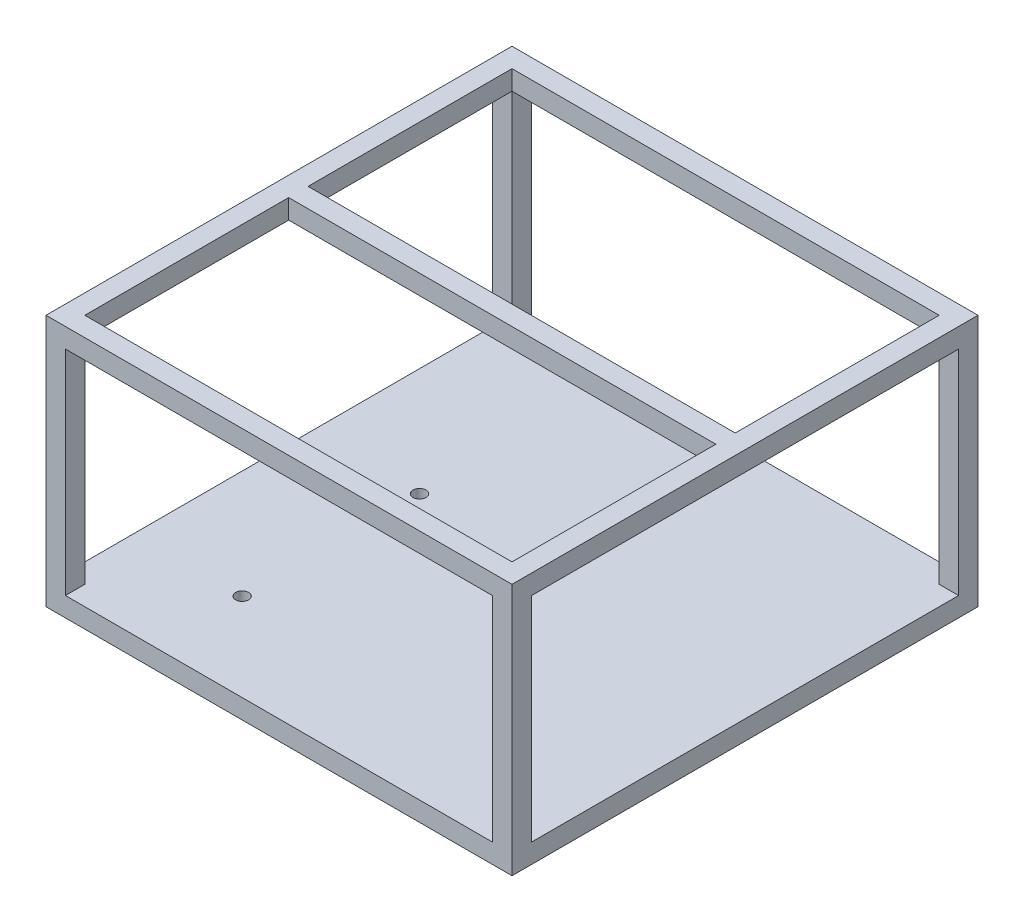
ISO-10303-21;
HEADER;
FILE_DESCRIPTION(('STEP AP214'),'2;1');
FILE_NAME('part.step','',(''),(''),'','','');
FILE_SCHEMA(('AUTOMOTIVE_DESIGN { 1 0 10303 214 1 1 1 1 }'));
ENDSEC;
DATA;
#1=APPLICATION_CONTEXT('core data for automotive mechanical design processes');
#2=APPLICATION_PROTOCOL_DEFINITION('international standard','automotive_design',2000,#1);
#3=PRODUCT_CONTEXT('',#1,'mechanical');
#4=PRODUCT('Part','Part','',(#3));
#5=PRODUCT_RELATED_PRODUCT_CATEGORY('part','',(#4));
#6=PRODUCT_DEFINITION_FORMATION('','',#4);
#7=PRODUCT_DEFINITION_CONTEXT('part definition',#1,'design');
#8=PRODUCT_DEFINITION('design','',#6,#7);
#9=PRODUCT_DEFINITION_SHAPE('','',#8);
#10=(LENGTH_UNIT() NAMED_UNIT(*) SI_UNIT(.MILLI.,.METRE.));
#11=(NAMED_UNIT(*) PLANE_ANGLE_UNIT() SI_UNIT($,.RADIAN.));
#12=(NAMED_UNIT(*) SI_UNIT($,.STERADIAN.) SOLID_ANGLE_UNIT());
#13=UNCERTAINTY_MEASURE_WITH_UNIT(LENGTH_MEASURE(1.E-05),#10,'distance_accuracy_value','');
#14=(GEOMETRIC_REPRESENTATION_CONTEXT(3) GLOBAL_UNCERTAINTY_ASSIGNED_CONTEXT((#13)) GLOBAL_UNIT_ASSIGNED_CONTEXT((#10,
#11,#12)) REPRESENTATION_CONTEXT('',''));
#15=CARTESIAN_POINT('',(0.,0.,0.));
#16=DIRECTION('',(0.,0.,1.));
#17=DIRECTION('',(1.,0.,0.));
#18=AXIS2_PLACEMENT_3D('',#15,#16,#17);
#19=CARTESIAN_POINT('',(110.62658396301,82.55,30.8378605629459));
#20=DIRECTION('',(1.,0.,0.));
#21=DIRECTION('',(0.,0.,-1.));
#22=AXIS2_PLACEMENT_3D('',#19,#20,#21);
#23=PLANE('',#22);
#24=DIRECTION('',(0.,-1.,0.));
#25=VECTOR('',#24,1.);
#26=CARTESIAN_POINT('',(110.62658396301,82.55,-42.1720858432598));
#27=LINE('',#26,#25);
#28=CARTESIAN_POINT('',(110.62658396301,82.55,-42.1720858432598));
#29=VERTEX_POINT('',#28);
#30=CARTESIAN_POINT('',(110.62658396301,76.1659043542835,-42.1720858432598));
#31=VERTEX_POINT('',#30);
#32=EDGE_CURVE('E205',#29,#31,#27,.T.);
#33=ORIENTED_EDGE('',*,*,#32,.T.);
#34=DIRECTION('',(0.,0.,1.));
#35=VECTOR('',#34,1.);
#36=CARTESIAN_POINT('',(110.62658396301,76.1659043542835,-115.212139437054));
#37=LINE('',#36,#35);
#38=CARTESIAN_POINT('',(110.62658396301,76.1659043542835,24.487860562946));
#39=VERTEX_POINT('',#38);
#40=EDGE_CURVE('E191',#31,#39,#37,.T.);
#41=ORIENTED_EDGE('',*,*,#40,.T.);
#42=DIRECTION('',(0.,1.,0.));
#43=VECTOR('',#42,1.);
#44=CARTESIAN_POINT('',(110.62658396301,82.55,24.487860562946));
#45=LINE('',#44,#43);
#46=CARTESIAN_POINT('',(110.62658396301,82.55,24.487860562946));
#47=VERTEX_POINT('',#46);
#48=EDGE_CURVE('E252',#39,#47,#45,.T.);
#49=ORIENTED_EDGE('',*,*,#48,.T.);
#50=DIRECTION('',(0.,0.,1.));
#51=VECTOR('',#50,1.);
#52=CARTESIAN_POINT('',(110.62658396301,82.55,30.8378605629459));
#53=LINE('',#52,#51);
#54=EDGE_CURVE('E55',#29,#47,#53,.T.);
#55=ORIENTED_EDGE('',*,*,#54,.F.);
#56=EDGE_LOOP('',(#33,#41,#49,#55));
#57=FACE_BOUND('',#56,.T.);
#58=ADVANCED_FACE('F39',(#57),#23,.F.);
#59=DIRECTION('',(0.,1.,0.));
#60=VECTOR('',#59,1.);
#61=CARTESIAN_POINT('',(110.62658396301,82.55,-48.5220858432598));
#62=LINE('',#61,#60);
#63=CARTESIAN_POINT('',(110.62658396301,76.1659043542835,-48.5220858432598));
#64=VERTEX_POINT('',#63);
#65=CARTESIAN_POINT('',(110.62658396301,82.55,-48.5220858432598));
#66=VERTEX_POINT('',#65);
#67=EDGE_CURVE('E63',#64,#66,#62,.T.);
#68=ORIENTED_EDGE('',*,*,#67,.T.);
#69=CARTESIAN_POINT('',(110.62658396301,82.55,-115.212139437054));
#70=VERTEX_POINT('',#69);
#71=EDGE_CURVE('E367',#70,#66,#53,.T.);
#72=ORIENTED_EDGE('',*,*,#71,.F.);
#73=DIRECTION('',(0.,-1.,0.));
#74=VECTOR('',#73,1.);
#75=CARTESIAN_POINT('',(110.62658396301,82.55,-115.212139437054));
#76=LINE('',#75,#74);
#77=CARTESIAN_POINT('',(110.62658396301,76.1659043542835,-115.212139437054));
#78=VERTEX_POINT('',#77);
#79=EDGE_CURVE('E225',#70,#78,#76,.T.);
#80=ORIENTED_EDGE('',*,*,#79,.T.);
#81=EDGE_CURVE('E201',#78,#64,#37,.T.);
#82=ORIENTED_EDGE('',*,*,#81,.T.);
#83=EDGE_LOOP('',(#68,#72,#80,#82));
#84=FACE_BOUND('',#83,.T.);
#85=ADVANCED_FACE('F473',(#84),#23,.F.);
#86=CARTESIAN_POINT('',(-29.07341603699,82.55,30.8378605629459));
#87=DIRECTION('',(-1.,0.,0.));
#88=DIRECTION('',(0.,0.,1.));
#89=AXIS2_PLACEMENT_3D('',#86,#87,#88);
#90=PLANE('',#89);
#91=DIRECTION('',(0.,-1.,0.));
#92=VECTOR('',#91,1.);
#93=CARTESIAN_POINT('',(-29.07341603699,82.55,-42.1720858432598));
#94=LINE('',#93,#92);
#95=CARTESIAN_POINT('',(-29.07341603699,82.55,-42.1720858432598));
#96=VERTEX_POINT('',#95);
#97=CARTESIAN_POINT('',(-29.07341603699,76.1659043542835,-42.1720858432598));
#98=VERTEX_POINT('',#97);
#99=EDGE_CURVE('E212',#96,#98,#94,.T.);
#100=ORIENTED_EDGE('',*,*,#99,.F.);
#101=DIRECTION('',(0.,0.,-1.));
#102=VECTOR('',#101,1.);
#103=CARTESIAN_POINT('',(-29.07341603699,82.55,30.8378605629459));
#104=LINE('',#103,#102);
#105=CARTESIAN_POINT('',(-29.07341603699,82.55,24.487860562946));
#106=VERTEX_POINT('',#105);
#107=EDGE_CURVE('E342',#106,#96,#104,.T.);
#108=ORIENTED_EDGE('',*,*,#107,.F.);
#109=DIRECTION('',(0.,1.,0.));
#110=VECTOR('',#109,1.);
#111=CARTESIAN_POINT('',(-29.07341603699,82.55,24.487860562946));
#112=LINE('',#111,#110);
#113=CARTESIAN_POINT('',(-29.07341603699,76.1659043542835,24.487860562946));
#114=VERTEX_POINT('',#113);
#115=EDGE_CURVE('E253',#114,#106,#112,.T.);
#116=ORIENTED_EDGE('',*,*,#115,.F.);
#117=DIRECTION('',(0.,0.,1.));
#118=VECTOR('',#117,1.);
#119=CARTESIAN_POINT('',(-29.07341603699,76.1659043542835,-115.212139437054));
#120=LINE('',#119,#118);
#121=EDGE_CURVE('E283',#98,#114,#120,.T.);
#122=ORIENTED_EDGE('',*,*,#121,.F.);
#123=EDGE_LOOP('',(#100,#108,#116,#122));
#124=FACE_BOUND('',#123,.T.);
#125=ADVANCED_FACE('F479',(#124),#90,.F.);
#126=DIRECTION('',(0.,1.,0.));
#127=VECTOR('',#126,1.);
#128=CARTESIAN_POINT('',(-29.07341603699,82.55,-48.5220858432598));
#129=LINE('',#128,#127);
#130=CARTESIAN_POINT('',(-29.07341603699,76.1659043542835,-48.5220858432598));
#131=VERTEX_POINT('',#130);
#132=CARTESIAN_POINT('',(-29.07341603699,82.55,-48.5220858432598));
#133=VERTEX_POINT('',#132);
#134=EDGE_CURVE('E208',#131,#133,#129,.T.);
#135=ORIENTED_EDGE('',*,*,#134,.F.);
#136=CARTESIAN_POINT('',(-29.07341603699,76.1659043542835,-115.212139437054));
#137=VERTEX_POINT('',#136);
#138=EDGE_CURVE('E284',#137,#131,#120,.T.);
#139=ORIENTED_EDGE('',*,*,#138,.F.);
#140=DIRECTION('',(0.,-1.,0.));
#141=VECTOR('',#140,1.);
#142=CARTESIAN_POINT('',(-29.07341603699,82.55,-115.212139437054));
#143=LINE('',#142,#141);
#144=CARTESIAN_POINT('',(-29.07341603699,82.55,-115.212139437054));
#145=VERTEX_POINT('',#144);
#146=EDGE_CURVE('E214',#145,#137,#143,.T.);
#147=ORIENTED_EDGE('',*,*,#146,.F.);
#148=EDGE_CURVE('E340',#133,#145,#104,.T.);
#149=ORIENTED_EDGE('',*,*,#148,.F.);
#150=EDGE_LOOP('',(#135,#139,#147,#149));
#151=FACE_BOUND('',#150,.T.);
#152=ADVANCED_FACE('F495',(#151),#90,.F.);
#153=DIRECTION('',(0.,0.,-1.));
#154=VECTOR('',#153,1.);
#155=CARTESIAN_POINT('',(110.62658396301,76.1659043542835,-121.562139437054));
#156=LINE('',#155,#154);
#157=CARTESIAN_POINT('',(110.62658396301,76.1659043542835,-121.562139437054));
#158=VERTEX_POINT('',#157);
#159=EDGE_CURVE('E229',#78,#158,#156,.T.);
#160=ORIENTED_EDGE('',*,*,#159,.T.);
#161=DIRECTION('',(0.,-1.,0.));
#162=VECTOR('',#161,1.);
#163=CARTESIAN_POINT('',(110.62658396301,82.55,-121.562139437054));
#164=LINE('',#163,#162);
#165=CARTESIAN_POINT('',(110.62658396301,6.34999999999999,-121.562139437054));
#166=VERTEX_POINT('',#165);
#167=EDGE_CURVE('E311',#158,#166,#164,.T.);
#168=ORIENTED_EDGE('',*,*,#167,.T.);
#169=DIRECTION('',(0.,0.,1.));
#170=VECTOR('',#169,1.);
#171=CARTESIAN_POINT('',(110.62658396301,6.34999999999999,-121.562139437054));
#172=LINE('',#171,#170);
#173=CARTESIAN_POINT('',(110.62658396301,6.34999999999999,-115.212139437054));
#174=VERTEX_POINT('',#173);
#175=EDGE_CURVE('E297',#166,#174,#172,.T.);
#176=ORIENTED_EDGE('',*,*,#175,.T.);
#177=DIRECTION('',(0.,-1.,0.));
#178=VECTOR('',#177,1.);
#179=CARTESIAN_POINT('',(110.62658396301,82.55,-115.212139437054));
#180=LINE('',#179,#178);
#181=EDGE_CURVE('E308',#78,#174,#180,.T.);
#182=ORIENTED_EDGE('',*,*,#181,.F.);
#183=EDGE_LOOP('',(#160,#168,#176,#182));
#184=FACE_BOUND('',#183,.T.);
#185=ADVANCED_FACE('F480',(#184),#23,.F.);
#186=DIRECTION('',(0.,0.,-1.));
#187=VECTOR('',#186,1.);
#188=CARTESIAN_POINT('',(-29.07341603699,76.1659043542835,-121.562139437054));
#189=LINE('',#188,#187);
#190=CARTESIAN_POINT('',(-29.07341603699,76.1659043542835,-121.562139437054));
#191=VERTEX_POINT('',#190);
#192=EDGE_CURVE('E219',#137,#191,#189,.T.);
#193=ORIENTED_EDGE('',*,*,#192,.F.);
#194=DIRECTION('',(0.,-1.,0.));
#195=VECTOR('',#194,1.);
#196=CARTESIAN_POINT('',(-29.07341603699,82.55,-115.212139437054));
#197=LINE('',#196,#195);
#198=CARTESIAN_POINT('',(-29.07341603699,6.34999999999999,-115.212139437054));
#199=VERTEX_POINT('',#198);
#200=EDGE_CURVE('E329',#137,#199,#197,.T.);
#201=ORIENTED_EDGE('',*,*,#200,.T.);
#202=DIRECTION('',(0.,0.,-1.));
#203=VECTOR('',#202,1.);
#204=CARTESIAN_POINT('',(-29.07341603699,6.34999999999999,-121.562139437054));
#205=LINE('',#204,#203);
#206=CARTESIAN_POINT('',(-29.07341603699,6.34999999999999,-121.562139437054));
#207=VERTEX_POINT('',#206);
#208=EDGE_CURVE('E320',#199,#207,#205,.T.);
#209=ORIENTED_EDGE('',*,*,#208,.T.);
#210=DIRECTION('',(0.,-1.,0.));
#211=VECTOR('',#210,1.);
#212=CARTESIAN_POINT('',(-29.07341603699,82.55,-121.562139437054));
#213=LINE('',#212,#211);
#214=EDGE_CURVE('E319',#191,#207,#213,.T.);
#215=ORIENTED_EDGE('',*,*,#214,.F.);
#216=EDGE_LOOP('',(#193,#201,#209,#215));
#217=FACE_BOUND('',#216,.T.);
#218=ADVANCED_FACE('F485',(#217),#90,.F.);
#219=DIRECTION('',(0.,0.,-1.));
#220=VECTOR('',#219,1.);
#221=CARTESIAN_POINT('',(110.62658396301,76.1659043542835,30.8378605629459));
#222=LINE('',#221,#220);
#223=CARTESIAN_POINT('',(110.62658396301,76.1659043542835,30.8378605629459));
#224=VERTEX_POINT('',#223);
#225=EDGE_CURVE('E248',#224,#39,#222,.T.);
#226=ORIENTED_EDGE('',*,*,#225,.T.);
#227=DIRECTION('',(0.,-1.,0.));
#228=VECTOR('',#227,1.);
#229=CARTESIAN_POINT('',(110.62658396301,82.55,24.487860562946));
#230=LINE('',#229,#228);
#231=CARTESIAN_POINT('',(110.62658396301,6.34999999999999,24.487860562946));
#232=VERTEX_POINT('',#231);
#233=EDGE_CURVE('E383',#39,#232,#230,.T.);
#234=ORIENTED_EDGE('',*,*,#233,.T.);
#235=DIRECTION('',(0.,0.,1.));
#236=VECTOR('',#235,1.);
#237=CARTESIAN_POINT('',(110.62658396301,6.34999999999999,30.8378605629459));
#238=LINE('',#237,#236);
#239=CARTESIAN_POINT('',(110.62658396301,6.34999999999999,30.8378605629459));
#240=VERTEX_POINT('',#239);
#241=EDGE_CURVE('E366',#232,#240,#238,.T.);
#242=ORIENTED_EDGE('',*,*,#241,.T.);
#243=DIRECTION('',(0.,-1.,0.));
#244=VECTOR('',#243,1.);
#245=CARTESIAN_POINT('',(110.62658396301,82.55,30.8378605629459));
#246=LINE('',#245,#244);
#247=EDGE_CURVE('E374',#224,#240,#246,.T.);
#248=ORIENTED_EDGE('',*,*,#247,.F.);
#249=EDGE_LOOP('',(#226,#234,#242,#248));
#250=FACE_BOUND('',#249,.T.);
#251=ADVANCED_FACE('F475',(#250),#23,.F.);
#252=DIRECTION('',(0.,0.,-1.));
#253=VECTOR('',#252,1.);
#254=CARTESIAN_POINT('',(-29.07341603699,76.1659043542835,30.8378605629459));
#255=LINE('',#254,#253);
#256=CARTESIAN_POINT('',(-29.07341603699,76.1659043542835,30.8378605629459));
#257=VERTEX_POINT('',#256);
#258=EDGE_CURVE('E247',#257,#114,#255,.T.);
#259=ORIENTED_EDGE('',*,*,#258,.F.);
#260=DIRECTION('',(0.,-1.,0.));
#261=VECTOR('',#260,1.);
#262=CARTESIAN_POINT('',(-29.07341603699,82.55,30.8378605629459));
#263=LINE('',#262,#261);
#264=CARTESIAN_POINT('',(-29.07341603699,6.34999999999999,30.8378605629459));
#265=VERTEX_POINT('',#264);
#266=EDGE_CURVE('E358',#257,#265,#263,.T.);
#267=ORIENTED_EDGE('',*,*,#266,.T.);
#268=DIRECTION('',(0.,0.,-1.));
#269=VECTOR('',#268,1.);
#270=CARTESIAN_POINT('',(-29.07341603699,6.34999999999999,30.8378605629459));
#271=LINE('',#270,#269);
#272=CARTESIAN_POINT('',(-29.07341603699,6.34999999999999,24.4878605629459));
#273=VERTEX_POINT('',#272);
#274=EDGE_CURVE('E335',#265,#273,#271,.T.);
#275=ORIENTED_EDGE('',*,*,#274,.T.);
#276=DIRECTION('',(0.,-1.,0.));
#277=VECTOR('',#276,1.);
#278=CARTESIAN_POINT('',(-29.07341603699,82.55,24.4878605629459));
#279=LINE('',#278,#277);
#280=EDGE_CURVE('E355',#114,#273,#279,.T.);
#281=ORIENTED_EDGE('',*,*,#280,.F.);
#282=EDGE_LOOP('',(#259,#267,#275,#281));
#283=FACE_BOUND('',#282,.T.);
#284=ADVANCED_FACE('F484',(#283),#90,.F.);
#285=CARTESIAN_POINT('',(-35.4234160369899,82.55,24.4878605629459));
#286=DIRECTION('',(0.,0.,1.));
#287=DIRECTION('',(1.,0.,0.));
#288=AXIS2_PLACEMENT_3D('',#285,#286,#287);
#289=PLANE('',#288);
#290=DIRECTION('',(-1.,0.,0.));
#291=VECTOR('',#290,1.);
#292=CARTESIAN_POINT('',(-29.07341603699,76.1659043542835,24.487860562946));
#293=LINE('',#292,#291);
#294=CARTESIAN_POINT('',(-35.4234160369899,76.1659043542835,24.487860562946));
#295=VERTEX_POINT('',#294);
#296=EDGE_CURVE('E272',#114,#295,#293,.T.);
#297=ORIENTED_EDGE('',*,*,#296,.F.);
#298=ORIENTED_EDGE('',*,*,#280,.T.);
#299=DIRECTION('',(-1.,0.,0.));
#300=VECTOR('',#299,1.);
#301=CARTESIAN_POINT('',(-35.4234160369899,6.34999999999999,24.4878605629459));
#302=LINE('',#301,#300);
#303=CARTESIAN_POINT('',(-35.4234160369899,6.34999999999999,24.4878605629459));
#304=VERTEX_POINT('',#303);
#305=EDGE_CURVE('E341',#273,#304,#302,.T.);
#306=ORIENTED_EDGE('',*,*,#305,.T.);
#307=DIRECTION('',(0.,-1.,0.));
#308=VECTOR('',#307,1.);
#309=CARTESIAN_POINT('',(-35.4234160369899,82.55,24.4878605629459));
#310=LINE('',#309,#308);
#311=EDGE_CURVE('E346',#295,#304,#310,.T.);
#312=ORIENTED_EDGE('',*,*,#311,.F.);
#313=EDGE_LOOP('',(#297,#298,#306,#312));
#314=FACE_BOUND('',#313,.T.);
#315=ADVANCED_FACE('F491',(#314),#289,.F.);
#316=CARTESIAN_POINT('',(-35.42341603699,82.55,-115.212139437054));
#317=DIRECTION('',(0.,0.,-1.));
#318=DIRECTION('',(-1.,0.,0.));
#319=AXIS2_PLACEMENT_3D('',#316,#317,#318);
#320=PLANE('',#319);
#321=DIRECTION('',(-1.,0.,0.));
#322=VECTOR('',#321,1.);
#323=CARTESIAN_POINT('',(-29.07341603699,76.1659043542835,-115.212139437054));
#324=LINE('',#323,#322);
#325=CARTESIAN_POINT('',(-35.4234160369899,76.1659043542835,-115.212139437054));
#326=VERTEX_POINT('',#325);
#327=EDGE_CURVE('E273',#137,#326,#324,.T.);
#328=ORIENTED_EDGE('',*,*,#327,.T.);
#329=DIRECTION('',(0.,-1.,0.));
#330=VECTOR('',#329,1.);
#331=CARTESIAN_POINT('',(-35.42341603699,82.55,-115.212139437054));
#332=LINE('',#331,#330);
#333=CARTESIAN_POINT('',(-35.42341603699,6.34999999999999,-115.212139437054));
#334=VERTEX_POINT('',#333);
#335=EDGE_CURVE('E332',#326,#334,#332,.T.);
#336=ORIENTED_EDGE('',*,*,#335,.T.);
#337=DIRECTION('',(1.,0.,0.));
#338=VECTOR('',#337,1.);
#339=CARTESIAN_POINT('',(-35.42341603699,6.34999999999999,-115.212139437054));
#340=LINE('',#339,#338);
#341=EDGE_CURVE('E314',#334,#199,#340,.T.);
#342=ORIENTED_EDGE('',*,*,#341,.T.);
#343=ORIENTED_EDGE('',*,*,#200,.F.);
#344=EDGE_LOOP('',(#328,#336,#342,#343));
#345=FACE_BOUND('',#344,.T.);
#346=ADVANCED_FACE('F557',(#345),#320,.F.);
#347=CARTESIAN_POINT('',(116.97658396301,82.55,24.487860562946));
#348=DIRECTION('',(0.,0.,1.));
#349=DIRECTION('',(1.,0.,0.));
#350=AXIS2_PLACEMENT_3D('',#347,#348,#349);
#351=PLANE('',#350);
#352=DIRECTION('',(-1.,0.,0.));
#353=VECTOR('',#352,1.);
#354=CARTESIAN_POINT('',(110.62658396301,76.1659043542835,24.487860562946));
#355=LINE('',#354,#353);
#356=CARTESIAN_POINT('',(116.97658396301,76.1659043542835,24.487860562946));
#357=VERTEX_POINT('',#356);
#358=EDGE_CURVE('E197',#357,#39,#355,.T.);
#359=ORIENTED_EDGE('',*,*,#358,.F.);
#360=DIRECTION('',(0.,-1.,0.));
#361=VECTOR('',#360,1.);
#362=CARTESIAN_POINT('',(116.97658396301,82.55,24.487860562946));
#363=LINE('',#362,#361);
#364=CARTESIAN_POINT('',(116.97658396301,6.34999999999999,24.4878605629459));
#365=VERTEX_POINT('',#364);
#366=EDGE_CURVE('E386',#357,#365,#363,.T.);
#367=ORIENTED_EDGE('',*,*,#366,.T.);
#368=DIRECTION('',(-1.,0.,0.));
#369=VECTOR('',#368,1.);
#370=CARTESIAN_POINT('',(116.97658396301,6.34999999999999,24.487860562946));
#371=LINE('',#370,#369);
#372=EDGE_CURVE('E361',#365,#232,#371,.T.);
#373=ORIENTED_EDGE('',*,*,#372,.T.);
#374=ORIENTED_EDGE('',*,*,#233,.F.);
#375=EDGE_LOOP('',(#359,#367,#373,#374));
#376=FACE_BOUND('',#375,.T.);
#377=ADVANCED_FACE('F579',(#376),#351,.F.);
#378=CARTESIAN_POINT('',(116.97658396301,82.55,-115.212139437054));
#379=DIRECTION('',(0.,0.,-1.));
#380=DIRECTION('',(-1.,0.,0.));
#381=AXIS2_PLACEMENT_3D('',#378,#379,#380);
#382=PLANE('',#381);
#383=DIRECTION('',(-1.,0.,0.));
#384=VECTOR('',#383,1.);
#385=CARTESIAN_POINT('',(110.62658396301,76.1659043542835,-115.212139437054));
#386=LINE('',#385,#384);
#387=CARTESIAN_POINT('',(116.97658396301,76.1659043542835,-115.212139437054));
#388=VERTEX_POINT('',#387);
#389=EDGE_CURVE('E202',#388,#78,#386,.T.);
#390=ORIENTED_EDGE('',*,*,#389,.T.);
#391=ORIENTED_EDGE('',*,*,#181,.T.);
#392=DIRECTION('',(1.,0.,0.));
#393=VECTOR('',#392,1.);
#394=CARTESIAN_POINT('',(116.97658396301,6.34999999999999,-115.212139437054));
#395=LINE('',#394,#393);
#396=CARTESIAN_POINT('',(116.97658396301,6.34999999999999,-115.212139437054));
#397=VERTEX_POINT('',#396);
#398=EDGE_CURVE('E301',#174,#397,#395,.T.);
#399=ORIENTED_EDGE('',*,*,#398,.T.);
#400=DIRECTION('',(0.,-1.,0.));
#401=VECTOR('',#400,1.);
#402=CARTESIAN_POINT('',(116.97658396301,82.55,-115.212139437054));
#403=LINE('',#402,#401);
#404=EDGE_CURVE('E305',#388,#397,#403,.T.);
#405=ORIENTED_EDGE('',*,*,#404,.F.);
#406=EDGE_LOOP('',(#390,#391,#399,#405));
#407=FACE_BOUND('',#406,.T.);
#408=ADVANCED_FACE('F517',(#407),#382,.F.);
#409=CARTESIAN_POINT('',(0.,6.34999999999999,0.));
#410=DIRECTION('',(0.,1.,0.));
#411=DIRECTION('',(0.,0.,1.));
#412=AXIS2_PLACEMENT_3D('',#409,#410,#411);
#413=PLANE('',#412);
#414=CARTESIAN_POINT('',(0.,6.34999999999999,2.125));
#415=DIRECTION('',(0.,1.,0.));
#416=DIRECTION('',(0.,0.,1.));
#417=AXIS2_PLACEMENT_3D('',#414,#415,#416);
#418=CIRCLE('',#417,2.125);
#419=CARTESIAN_POINT('',(0.,6.34999999999999,4.25));
#420=VERTEX_POINT('',#419);
#421=EDGE_CURVE('E395',#420,#420,#418,.T.);
#422=ORIENTED_EDGE('',*,*,#421,.F.);
#423=EDGE_LOOP('',(#422));
#424=FACE_BOUND('',#423,.T.);
#425=CARTESIAN_POINT('',(0.,6.34999999999999,-55.889));
#426=DIRECTION('',(0.,1.,0.));
#427=DIRECTION('',(0.,0.,1.));
#428=AXIS2_PLACEMENT_3D('',#425,#426,#427);
#429=CIRCLE('',#428,2.125);
#430=CARTESIAN_POINT('',(0.,6.34999999999999,-53.764));
#431=VERTEX_POINT('',#430);
#432=EDGE_CURVE('E389',#431,#431,#429,.T.);
#433=ORIENTED_EDGE('',*,*,#432,.F.);
#434=EDGE_LOOP('',(#433));
#435=FACE_BOUND('',#434,.T.);
#436=ORIENTED_EDGE('',*,*,#398,.F.);
#437=ORIENTED_EDGE('',*,*,#175,.F.);
#438=DIRECTION('',(-1.,0.,0.));
#439=VECTOR('',#438,1.);
#440=CARTESIAN_POINT('',(-35.42341603699,6.34999999999999,-121.562139437054));
#441=LINE('',#440,#439);
#442=EDGE_CURVE('E419',#166,#207,#441,.T.);
#443=ORIENTED_EDGE('',*,*,#442,.T.);
#444=ORIENTED_EDGE('',*,*,#208,.F.);
#445=ORIENTED_EDGE('',*,*,#341,.F.);
#446=DIRECTION('',(0.,0.,1.));
#447=VECTOR('',#446,1.);
#448=CARTESIAN_POINT('',(-35.42341603699,6.34999999999999,-121.562139437054));
#449=LINE('',#448,#447);
#450=EDGE_CURVE('E406',#334,#304,#449,.T.);
#451=ORIENTED_EDGE('',*,*,#450,.T.);
#452=ORIENTED_EDGE('',*,*,#305,.F.);
#453=ORIENTED_EDGE('',*,*,#274,.F.);
#454=DIRECTION('',(1.,0.,0.));
#455=VECTOR('',#454,1.);
#456=CARTESIAN_POINT('',(-35.4234160369899,6.34999999999999,30.8378605629459));
#457=LINE('',#456,#455);
#458=EDGE_CURVE('E410',#265,#240,#457,.T.);
#459=ORIENTED_EDGE('',*,*,#458,.T.);
#460=ORIENTED_EDGE('',*,*,#241,.F.);
#461=ORIENTED_EDGE('',*,*,#372,.F.);
#462=DIRECTION('',(0.,0.,-1.));
#463=VECTOR('',#462,1.);
#464=CARTESIAN_POINT('',(116.97658396301,6.34999999999999,-121.562139437054));
#465=LINE('',#464,#463);
#466=EDGE_CURVE('E415',#365,#397,#465,.T.);
#467=ORIENTED_EDGE('',*,*,#466,.T.);
#468=EDGE_LOOP('',(#436,#437,#443,#444,#445,#451,#452,#453,#459,#460,#461,#467));
#469=FACE_BOUND('',#468,.T.);
#470=ADVANCED_FACE('F469',(#424,#435,#469),#413,.T.);
#471=CARTESIAN_POINT('',(-35.42341603699,6.34999999999999,-121.562139437054));
#472=DIRECTION('',(1.,0.,0.));
#473=DIRECTION('',(0.,0.,-1.));
#474=AXIS2_PLACEMENT_3D('',#471,#472,#473);
#475=PLANE('',#474);
#476=DIRECTION('',(0.,0.,1.));
#477=VECTOR('',#476,1.);
#478=CARTESIAN_POINT('',(-35.4234160369899,76.1659043542835,-115.212139437054));
#479=LINE('',#478,#477);
#480=EDGE_CURVE('E277',#326,#295,#479,.T.);
#481=ORIENTED_EDGE('',*,*,#480,.T.);
#482=ORIENTED_EDGE('',*,*,#311,.T.);
#483=ORIENTED_EDGE('',*,*,#450,.F.);
#484=ORIENTED_EDGE('',*,*,#335,.F.);
#485=EDGE_LOOP('',(#481,#482,#483,#484));
#486=FACE_BOUND('',#485,.T.);
#487=DIRECTION('',(0.,0.,1.));
#488=VECTOR('',#487,1.);
#489=CARTESIAN_POINT('',(-35.42341603699,0.,-121.562139437054));
#490=LINE('',#489,#488);
#491=CARTESIAN_POINT('',(-35.42341603699,0.,-121.562139437054));
#492=VERTEX_POINT('',#491);
#493=CARTESIAN_POINT('',(-35.4234160369899,0.,30.8378605629459));
#494=VERTEX_POINT('',#493);
#495=EDGE_CURVE('E394',#492,#494,#490,.T.);
#496=ORIENTED_EDGE('',*,*,#495,.T.);
#497=DIRECTION('',(0.,-1.,0.));
#498=VECTOR('',#497,1.);
#499=CARTESIAN_POINT('',(-35.4234160369899,6.34999999999999,30.8378605629459));
#500=LINE('',#499,#498);
#501=CARTESIAN_POINT('',(-35.4234160369899,82.55,30.8378605629459));
#502=VERTEX_POINT('',#501);
#503=EDGE_CURVE('E11',#502,#494,#500,.T.);
#504=ORIENTED_EDGE('',*,*,#503,.F.);
#505=DIRECTION('',(0.,0.,1.));
#506=VECTOR('',#505,1.);
#507=CARTESIAN_POINT('',(-35.4234160369899,82.55,30.8378605629459));
#508=LINE('',#507,#506);
#509=CARTESIAN_POINT('',(-35.42341603699,82.55,-121.562139437054));
#510=VERTEX_POINT('',#509);
#511=EDGE_CURVE('E336',#510,#502,#508,.T.);
#512=ORIENTED_EDGE('',*,*,#511,.F.);
#513=DIRECTION('',(0.,-1.,0.));
#514=VECTOR('',#513,1.);
#515=CARTESIAN_POINT('',(-35.42341603699,6.34999999999999,-121.562139437054));
#516=LINE('',#515,#514);
#517=EDGE_CURVE('E423',#510,#492,#516,.T.);
#518=ORIENTED_EDGE('',*,*,#517,.T.);
#519=EDGE_LOOP('',(#496,#504,#512,#518));
#520=FACE_BOUND('',#519,.T.);
#521=ADVANCED_FACE('F41',(#486,#520),#475,.F.);
#522=CARTESIAN_POINT('',(-35.4234160369899,6.34999999999999,30.8378605629459));
#523=DIRECTION('',(0.,0.,-1.));
#524=DIRECTION('',(-1.,0.,0.));
#525=AXIS2_PLACEMENT_3D('',#522,#523,#524);
#526=PLANE('',#525);
#527=DIRECTION('',(-1.,0.,0.));
#528=VECTOR('',#527,1.);
#529=CARTESIAN_POINT('',(110.62658396301,76.1659043542835,30.8378605629459));
#530=LINE('',#529,#528);
#531=EDGE_CURVE('E269',#224,#257,#530,.T.);
#532=ORIENTED_EDGE('',*,*,#531,.F.);
#533=ORIENTED_EDGE('',*,*,#247,.T.);
#534=ORIENTED_EDGE('',*,*,#458,.F.);
#535=ORIENTED_EDGE('',*,*,#266,.F.);
#536=EDGE_LOOP('',(#532,#533,#534,#535));
#537=FACE_BOUND('',#536,.T.);
#538=DIRECTION('',(1.,0.,0.));
#539=VECTOR('',#538,1.);
#540=CARTESIAN_POINT('',(-35.4234160369899,0.,30.8378605629459));
#541=LINE('',#540,#539);
#542=CARTESIAN_POINT('',(116.97658396301,0.,30.8378605629459));
#543=VERTEX_POINT('',#542);
#544=EDGE_CURVE('E427',#494,#543,#541,.T.);
#545=ORIENTED_EDGE('',*,*,#544,.T.);
#546=DIRECTION('',(0.,-1.,0.));
#547=VECTOR('',#546,1.);
#548=CARTESIAN_POINT('',(116.97658396301,6.34999999999999,30.8378605629459));
#549=LINE('',#548,#547);
#550=CARTESIAN_POINT('',(116.97658396301,82.55,30.8378605629459));
#551=VERTEX_POINT('',#550);
#552=EDGE_CURVE('E48',#551,#543,#549,.T.);
#553=ORIENTED_EDGE('',*,*,#552,.F.);
#554=DIRECTION('',(1.,0.,0.));
#555=VECTOR('',#554,1.);
#556=CARTESIAN_POINT('',(116.97658396301,82.55,30.8378605629459));
#557=LINE('',#556,#555);
#558=EDGE_CURVE('E370',#502,#551,#557,.T.);
#559=ORIENTED_EDGE('',*,*,#558,.F.);
#560=ORIENTED_EDGE('',*,*,#503,.T.);
#561=EDGE_LOOP('',(#545,#553,#559,#560));
#562=FACE_BOUND('',#561,.T.);
#563=ADVANCED_FACE('F460',(#537,#562),#526,.F.);
#564=CARTESIAN_POINT('',(116.97658396301,6.34999999999999,-121.562139437054));
#565=DIRECTION('',(-1.,0.,0.));
#566=DIRECTION('',(0.,0.,1.));
#567=AXIS2_PLACEMENT_3D('',#564,#565,#566);
#568=PLANE('',#567);
#569=ORIENTED_EDGE('',*,*,#366,.F.);
#570=DIRECTION('',(0.,0.,1.));
#571=VECTOR('',#570,1.);
#572=CARTESIAN_POINT('',(116.97658396301,76.1659043542835,-115.212139437054));
#573=LINE('',#572,#571);
#574=EDGE_CURVE('E294',#388,#357,#573,.T.);
#575=ORIENTED_EDGE('',*,*,#574,.F.);
#576=ORIENTED_EDGE('',*,*,#404,.T.);
#577=ORIENTED_EDGE('',*,*,#466,.F.);
#578=EDGE_LOOP('',(#569,#575,#576,#577));
#579=FACE_BOUND('',#578,.T.);
#580=DIRECTION('',(0.,0.,-1.));
#581=VECTOR('',#580,1.);
#582=CARTESIAN_POINT('',(116.97658396301,0.,-121.562139437054));
#583=LINE('',#582,#581);
#584=CARTESIAN_POINT('',(116.97658396301,0.,-121.562139437054));
#585=VERTEX_POINT('',#584);
#586=EDGE_CURVE('E430',#543,#585,#583,.T.);
#587=ORIENTED_EDGE('',*,*,#586,.T.);
#588=DIRECTION('',(0.,-1.,0.));
#589=VECTOR('',#588,1.);
#590=CARTESIAN_POINT('',(116.97658396301,6.34999999999999,-121.562139437054));
#591=LINE('',#590,#589);
#592=CARTESIAN_POINT('',(116.97658396301,82.55,-121.562139437054));
#593=VERTEX_POINT('',#592);
#594=EDGE_CURVE('E438',#593,#585,#591,.T.);
#595=ORIENTED_EDGE('',*,*,#594,.F.);
#596=DIRECTION('',(0.,0.,-1.));
#597=VECTOR('',#596,1.);
#598=CARTESIAN_POINT('',(116.97658396301,82.55,30.8378605629459));
#599=LINE('',#598,#597);
#600=EDGE_CURVE('E362',#551,#593,#599,.T.);
#601=ORIENTED_EDGE('',*,*,#600,.F.);
#602=ORIENTED_EDGE('',*,*,#552,.T.);
#603=EDGE_LOOP('',(#587,#595,#601,#602));
#604=FACE_BOUND('',#603,.T.);
#605=ADVANCED_FACE('F446',(#579,#604),#568,.F.);
#606=CARTESIAN_POINT('',(-35.42341603699,6.34999999999999,-121.562139437054));
#607=DIRECTION('',(0.,0.,1.));
#608=DIRECTION('',(1.,0.,0.));
#609=AXIS2_PLACEMENT_3D('',#606,#607,#608);
#610=PLANE('',#609);
#611=ORIENTED_EDGE('',*,*,#167,.F.);
#612=DIRECTION('',(-1.,0.,0.));
#613=VECTOR('',#612,1.);
#614=CARTESIAN_POINT('',(110.62658396301,76.1659043542835,-121.562139437054));
#615=LINE('',#614,#613);
#616=EDGE_CURVE('E232',#158,#191,#615,.T.);
#617=ORIENTED_EDGE('',*,*,#616,.T.);
#618=ORIENTED_EDGE('',*,*,#214,.T.);
#619=ORIENTED_EDGE('',*,*,#442,.F.);
#620=EDGE_LOOP('',(#611,#617,#618,#619));
#621=FACE_BOUND('',#620,.T.);
#622=DIRECTION('',(-1.,0.,0.));
#623=VECTOR('',#622,1.);
#624=CARTESIAN_POINT('',(-35.42341603699,0.,-121.562139437054));
#625=LINE('',#624,#623);
#626=EDGE_CURVE('E411',#585,#492,#625,.T.);
#627=ORIENTED_EDGE('',*,*,#626,.T.);
#628=ORIENTED_EDGE('',*,*,#517,.F.);
#629=DIRECTION('',(-1.,0.,0.));
#630=VECTOR('',#629,1.);
#631=CARTESIAN_POINT('',(-35.42341603699,82.55,-121.562139437054));
#632=LINE('',#631,#630);
#633=EDGE_CURVE('E315',#593,#510,#632,.T.);
#634=ORIENTED_EDGE('',*,*,#633,.F.);
#635=ORIENTED_EDGE('',*,*,#594,.T.);
#636=EDGE_LOOP('',(#627,#628,#634,#635));
#637=FACE_BOUND('',#636,.T.);
#638=ADVANCED_FACE('F455',(#621,#637),#610,.F.);
#639=CARTESIAN_POINT('',(0.,0.,0.));
#640=DIRECTION('',(0.,1.,0.));
#641=DIRECTION('',(0.,0.,1.));
#642=AXIS2_PLACEMENT_3D('',#639,#640,#641);
#643=PLANE('',#642);
#644=CARTESIAN_POINT('',(0.,0.,2.125));
#645=DIRECTION('',(0.,1.,0.));
#646=DIRECTION('',(0.,0.,1.));
#647=AXIS2_PLACEMENT_3D('',#644,#645,#646);
#648=CIRCLE('',#647,2.125);
#649=CARTESIAN_POINT('',(0.,0.,4.25));
#650=VERTEX_POINT('',#649);
#651=EDGE_CURVE('E390',#650,#650,#648,.T.);
#652=ORIENTED_EDGE('',*,*,#651,.T.);
#653=EDGE_LOOP('',(#652));
#654=FACE_BOUND('',#653,.T.);
#655=CARTESIAN_POINT('',(0.,0.,-55.889));
#656=DIRECTION('',(0.,1.,0.));
#657=DIRECTION('',(0.,0.,1.));
#658=AXIS2_PLACEMENT_3D('',#655,#656,#657);
#659=CIRCLE('',#658,2.125);
#660=CARTESIAN_POINT('',(0.,0.,-53.764));
#661=VERTEX_POINT('',#660);
#662=EDGE_CURVE('E399',#661,#661,#659,.T.);
#663=ORIENTED_EDGE('',*,*,#662,.T.);
#664=EDGE_LOOP('',(#663));
#665=FACE_BOUND('',#664,.T.);
#666=ORIENTED_EDGE('',*,*,#495,.F.);
#667=ORIENTED_EDGE('',*,*,#626,.F.);
#668=ORIENTED_EDGE('',*,*,#586,.F.);
#669=ORIENTED_EDGE('',*,*,#544,.F.);
#670=EDGE_LOOP('',(#666,#667,#668,#669));
#671=FACE_BOUND('',#670,.T.);
#672=ADVANCED_FACE('F452',(#654,#665,#671),#643,.F.);
#673=CARTESIAN_POINT('',(0.,0.,-55.889));
#674=DIRECTION('',(0.,1.,0.));
#675=DIRECTION('',(0.,0.,1.));
#676=AXIS2_PLACEMENT_3D('',#673,#674,#675);
#677=CYLINDRICAL_SURFACE('',#676,2.125);
#678=ORIENTED_EDGE('',*,*,#662,.F.);
#679=EDGE_LOOP('',(#678));
#680=FACE_BOUND('',#679,.T.);
#681=ORIENTED_EDGE('',*,*,#432,.T.);
#682=EDGE_LOOP('',(#681));
#683=FACE_BOUND('',#682,.T.);
#684=ADVANCED_FACE('F589',(#680,#683),#677,.F.);
#685=CARTESIAN_POINT('',(0.,0.,2.125));
#686=DIRECTION('',(0.,1.,0.));
#687=DIRECTION('',(0.,0.,1.));
#688=AXIS2_PLACEMENT_3D('',#685,#686,#687);
#689=CYLINDRICAL_SURFACE('',#688,2.125);
#690=ORIENTED_EDGE('',*,*,#651,.F.);
#691=EDGE_LOOP('',(#690));
#692=FACE_BOUND('',#691,.T.);
#693=ORIENTED_EDGE('',*,*,#421,.T.);
#694=EDGE_LOOP('',(#693));
#695=FACE_BOUND('',#694,.T.);
#696=ADVANCED_FACE('F584',(#692,#695),#689,.F.);
#697=CARTESIAN_POINT('',(0.,82.55,0.));
#698=DIRECTION('',(0.,1.,0.));
#699=DIRECTION('',(0.,0.,1.));
#700=AXIS2_PLACEMENT_3D('',#697,#698,#699);
#701=PLANE('',#700);
#702=DIRECTION('',(-1.,0.,0.));
#703=VECTOR('',#702,1.);
#704=CARTESIAN_POINT('',(110.62658396301,82.55,-42.1720858432598));
#705=LINE('',#704,#703);
#706=EDGE_CURVE('E592',#29,#96,#705,.T.);
#707=ORIENTED_EDGE('',*,*,#706,.F.);
#708=ORIENTED_EDGE('',*,*,#54,.T.);
#709=DIRECTION('',(-1.,0.,0.));
#710=VECTOR('',#709,1.);
#711=CARTESIAN_POINT('',(110.62658396301,82.55,24.487860562946));
#712=LINE('',#711,#710);
#713=EDGE_CURVE('E256',#47,#106,#712,.T.);
#714=ORIENTED_EDGE('',*,*,#713,.T.);
#715=ORIENTED_EDGE('',*,*,#107,.T.);
#716=EDGE_LOOP('',(#707,#708,#714,#715));
#717=FACE_BOUND('',#716,.T.);
#718=DIRECTION('',(-1.,0.,0.));
#719=VECTOR('',#718,1.);
#720=CARTESIAN_POINT('',(110.62658396301,82.55,-115.212139437054));
#721=LINE('',#720,#719);
#722=EDGE_CURVE('E243',#70,#145,#721,.T.);
#723=ORIENTED_EDGE('',*,*,#722,.F.);
#724=ORIENTED_EDGE('',*,*,#71,.T.);
#725=DIRECTION('',(-1.,0.,0.));
#726=VECTOR('',#725,1.);
#727=CARTESIAN_POINT('',(110.62658396301,82.55,-48.5220858432598));
#728=LINE('',#727,#726);
#729=EDGE_CURVE('E221',#66,#133,#728,.T.);
#730=ORIENTED_EDGE('',*,*,#729,.T.);
#731=ORIENTED_EDGE('',*,*,#148,.T.);
#732=EDGE_LOOP('',(#723,#724,#730,#731));
#733=FACE_BOUND('',#732,.T.);
#734=ORIENTED_EDGE('',*,*,#600,.T.);
#735=ORIENTED_EDGE('',*,*,#633,.T.);
#736=ORIENTED_EDGE('',*,*,#511,.T.);
#737=ORIENTED_EDGE('',*,*,#558,.T.);
#738=EDGE_LOOP('',(#734,#735,#736,#737));
#739=FACE_BOUND('',#738,.T.);
#740=ADVANCED_FACE('F459',(#717,#733,#739),#701,.T.);
#741=CARTESIAN_POINT('',(110.62658396301,76.1659043542835,-115.212139437054));
#742=DIRECTION('',(0.,1.,0.));
#743=DIRECTION('',(0.,0.,1.));
#744=AXIS2_PLACEMENT_3D('',#741,#742,#743);
#745=PLANE('',#744);
#746=ORIENTED_EDGE('',*,*,#358,.T.);
#747=ORIENTED_EDGE('',*,*,#40,.F.);
#748=DIRECTION('',(-1.,0.,0.));
#749=VECTOR('',#748,1.);
#750=CARTESIAN_POINT('',(110.62658396301,76.1659043542835,-42.1720858432598));
#751=LINE('',#750,#749);
#752=EDGE_CURVE('E194',#31,#98,#751,.T.);
#753=ORIENTED_EDGE('',*,*,#752,.T.);
#754=ORIENTED_EDGE('',*,*,#121,.T.);
#755=ORIENTED_EDGE('',*,*,#296,.T.);
#756=ORIENTED_EDGE('',*,*,#480,.F.);
#757=ORIENTED_EDGE('',*,*,#327,.F.);
#758=ORIENTED_EDGE('',*,*,#138,.T.);
#759=DIRECTION('',(-1.,0.,0.));
#760=VECTOR('',#759,1.);
#761=CARTESIAN_POINT('',(110.62658396301,76.1659043542835,-48.5220858432598));
#762=LINE('',#761,#760);
#763=EDGE_CURVE('E215',#64,#131,#762,.T.);
#764=ORIENTED_EDGE('',*,*,#763,.F.);
#765=ORIENTED_EDGE('',*,*,#81,.F.);
#766=ORIENTED_EDGE('',*,*,#389,.F.);
#767=ORIENTED_EDGE('',*,*,#574,.T.);
#768=EDGE_LOOP('',(#746,#747,#753,#754,#755,#756,#757,#758,#764,#765,#766,#767));
#769=FACE_BOUND('',#768,.T.);
#770=ADVANCED_FACE('F192',(#769),#745,.F.);
#771=CARTESIAN_POINT('',(110.62658396301,76.1659043542835,30.8378605629459));
#772=DIRECTION('',(0.,1.,0.));
#773=DIRECTION('',(0.,0.,1.));
#774=AXIS2_PLACEMENT_3D('',#771,#772,#773);
#775=PLANE('',#774);
#776=ORIENTED_EDGE('',*,*,#258,.T.);
#777=DIRECTION('',(-1.,0.,0.));
#778=VECTOR('',#777,1.);
#779=CARTESIAN_POINT('',(110.62658396301,76.1659043542835,24.487860562946));
#780=LINE('',#779,#778);
#781=EDGE_CURVE('E265',#39,#114,#780,.T.);
#782=ORIENTED_EDGE('',*,*,#781,.F.);
#783=ORIENTED_EDGE('',*,*,#225,.F.);
#784=ORIENTED_EDGE('',*,*,#531,.T.);
#785=EDGE_LOOP('',(#776,#782,#783,#784));
#786=FACE_BOUND('',#785,.T.);
#787=ADVANCED_FACE('F537',(#786),#775,.F.);
#788=CARTESIAN_POINT('',(110.62658396301,82.55,24.487860562946));
#789=DIRECTION('',(0.,0.,1.));
#790=DIRECTION('',(1.,0.,0.));
#791=AXIS2_PLACEMENT_3D('',#788,#789,#790);
#792=PLANE('',#791);
#793=ORIENTED_EDGE('',*,*,#115,.T.);
#794=ORIENTED_EDGE('',*,*,#713,.F.);
#795=ORIENTED_EDGE('',*,*,#48,.F.);
#796=ORIENTED_EDGE('',*,*,#781,.T.);
#797=EDGE_LOOP('',(#793,#794,#795,#796));
#798=FACE_BOUND('',#797,.T.);
#799=ADVANCED_FACE('F542',(#798),#792,.F.);
#800=CARTESIAN_POINT('',(110.62658396301,82.55,-115.212139437054));
#801=DIRECTION('',(0.,0.,-1.));
#802=DIRECTION('',(-1.,0.,0.));
#803=AXIS2_PLACEMENT_3D('',#800,#801,#802);
#804=PLANE('',#803);
#805=ORIENTED_EDGE('',*,*,#146,.T.);
#806=DIRECTION('',(-1.,0.,0.));
#807=VECTOR('',#806,1.);
#808=CARTESIAN_POINT('',(110.62658396301,76.1659043542835,-115.212139437054));
#809=LINE('',#808,#807);
#810=EDGE_CURVE('E239',#78,#137,#809,.T.);
#811=ORIENTED_EDGE('',*,*,#810,.F.);
#812=ORIENTED_EDGE('',*,*,#79,.F.);
#813=ORIENTED_EDGE('',*,*,#722,.T.);
#814=EDGE_LOOP('',(#805,#811,#812,#813));
#815=FACE_BOUND('',#814,.T.);
#816=ADVANCED_FACE('F523',(#815),#804,.F.);
#817=CARTESIAN_POINT('',(110.62658396301,76.1659043542835,-121.562139437054));
#818=DIRECTION('',(0.,1.,0.));
#819=DIRECTION('',(0.,0.,1.));
#820=AXIS2_PLACEMENT_3D('',#817,#818,#819);
#821=PLANE('',#820);
#822=ORIENTED_EDGE('',*,*,#192,.T.);
#823=ORIENTED_EDGE('',*,*,#616,.F.);
#824=ORIENTED_EDGE('',*,*,#159,.F.);
#825=ORIENTED_EDGE('',*,*,#810,.T.);
#826=EDGE_LOOP('',(#822,#823,#824,#825));
#827=FACE_BOUND('',#826,.T.);
#828=ADVANCED_FACE('F559',(#827),#821,.F.);
#829=CARTESIAN_POINT('',(110.62658396301,82.55,-42.1720858432598));
#830=DIRECTION('',(0.,0.,-1.));
#831=DIRECTION('',(0.,1.,0.));
#832=AXIS2_PLACEMENT_3D('',#829,#830,#831);
#833=PLANE('',#832);
#834=ORIENTED_EDGE('',*,*,#99,.T.);
#835=ORIENTED_EDGE('',*,*,#752,.F.);
#836=ORIENTED_EDGE('',*,*,#32,.F.);
#837=ORIENTED_EDGE('',*,*,#706,.T.);
#838=EDGE_LOOP('',(#834,#835,#836,#837));
#839=FACE_BOUND('',#838,.T.);
#840=ADVANCED_FACE('F210',(#839),#833,.F.);
#841=CARTESIAN_POINT('',(110.62658396301,82.55,-48.5220858432598));
#842=DIRECTION('',(0.,0.,1.));
#843=DIRECTION('',(1.,0.,0.));
#844=AXIS2_PLACEMENT_3D('',#841,#842,#843);
#845=PLANE('',#844);
#846=ORIENTED_EDGE('',*,*,#134,.T.);
#847=ORIENTED_EDGE('',*,*,#729,.F.);
#848=ORIENTED_EDGE('',*,*,#67,.F.);
#849=ORIENTED_EDGE('',*,*,#763,.T.);
#850=EDGE_LOOP('',(#846,#847,#848,#849));
#851=FACE_BOUND('',#850,.T.);
#852=ADVANCED_FACE('F566',(#851),#845,.F.);
#853=CLOSED_SHELL('',(#58,#85,#125,#152,#185,#218,#251,#284,#315,#346,#377,#408,#470,#521,#563,
#605,#638,#672,#684,#696,#740,#770,#787,#799,#816,#828,#840,#852));
#854=MANIFOLD_SOLID_BREP('B2',#853);
#855=ADVANCED_BREP_SHAPE_REPRESENTATION('',(#18,#854),#14);
#856=SHAPE_DEFINITION_REPRESENTATION(#9,#855);
ENDSEC;
END-ISO-10303-21;
